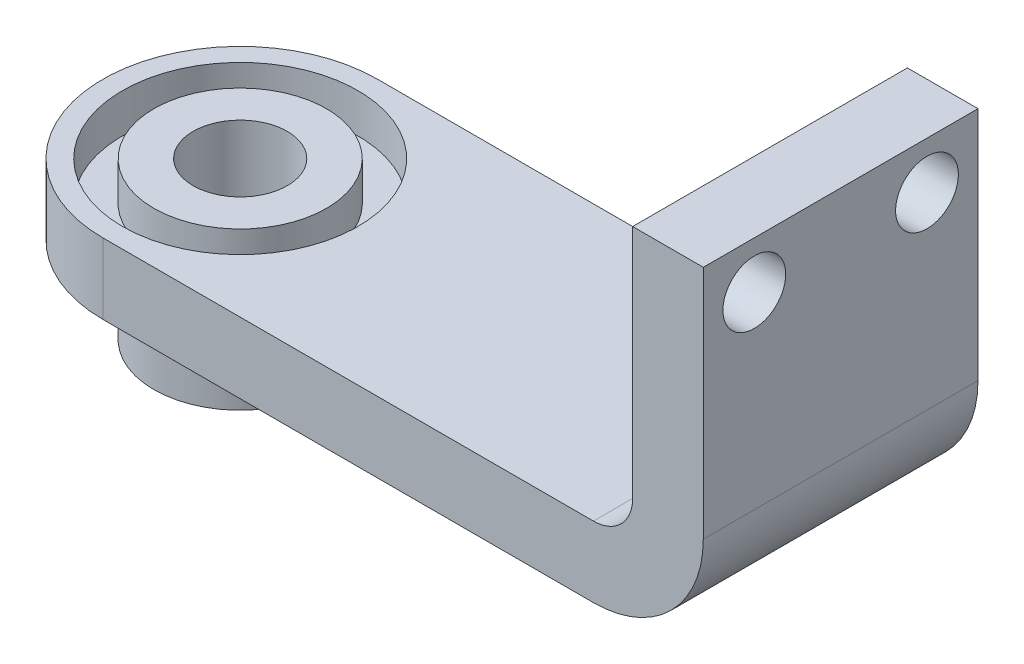
ISO-10303-21;
HEADER;
FILE_DESCRIPTION(('STEP AP214'),'2;1');
FILE_NAME('part.step','',(''),(''),'','','');
FILE_SCHEMA(('AUTOMOTIVE_DESIGN { 1 0 10303 214 1 1 1 1 }'));
ENDSEC;
DATA;
#1=APPLICATION_CONTEXT('core data for automotive mechanical design processes');
#2=APPLICATION_PROTOCOL_DEFINITION('international standard','automotive_design',2000,#1);
#3=PRODUCT_CONTEXT('',#1,'mechanical');
#4=PRODUCT('Part','Part','',(#3));
#5=PRODUCT_RELATED_PRODUCT_CATEGORY('part','',(#4));
#6=PRODUCT_DEFINITION_FORMATION('','',#4);
#7=PRODUCT_DEFINITION_CONTEXT('part definition',#1,'design');
#8=PRODUCT_DEFINITION('design','',#6,#7);
#9=PRODUCT_DEFINITION_SHAPE('','',#8);
#10=(LENGTH_UNIT() NAMED_UNIT(*) SI_UNIT(.MILLI.,.METRE.));
#11=(NAMED_UNIT(*) PLANE_ANGLE_UNIT() SI_UNIT($,.RADIAN.));
#12=(NAMED_UNIT(*) SI_UNIT($,.STERADIAN.) SOLID_ANGLE_UNIT());
#13=UNCERTAINTY_MEASURE_WITH_UNIT(LENGTH_MEASURE(1.E-05),#10,'distance_accuracy_value','');
#14=(GEOMETRIC_REPRESENTATION_CONTEXT(3) GLOBAL_UNCERTAINTY_ASSIGNED_CONTEXT((#13)) GLOBAL_UNIT_ASSIGNED_CONTEXT((#10,
#11,#12)) REPRESENTATION_CONTEXT('',''));
#15=CARTESIAN_POINT('',(0.,0.,0.));
#16=DIRECTION('',(0.,0.,1.));
#17=DIRECTION('',(1.,0.,0.));
#18=AXIS2_PLACEMENT_3D('',#15,#16,#17);
#19=CARTESIAN_POINT('',(-17.5,-20.,-17.5));
#20=DIRECTION('',(0.,1.,0.));
#21=DIRECTION('',(0.,0.,1.));
#22=AXIS2_PLACEMENT_3D('',#19,#20,#21);
#23=CYLINDRICAL_SURFACE('',#22,6.);
#24=CARTESIAN_POINT('',(-17.5,-20.,-17.5));
#25=DIRECTION('',(0.,1.,0.));
#26=DIRECTION('',(0.,0.,1.));
#27=AXIS2_PLACEMENT_3D('',#24,#25,#26);
#28=CIRCLE('',#27,6.);
#29=CARTESIAN_POINT('',(-17.5,-20.,-11.5));
#30=VERTEX_POINT('',#29);
#31=EDGE_CURVE('E50',#30,#30,#28,.T.);
#32=ORIENTED_EDGE('',*,*,#31,.F.);
#33=EDGE_LOOP('',(#32));
#34=FACE_BOUND('',#33,.T.);
#35=CARTESIAN_POINT('',(-17.5,0.,-17.5));
#36=DIRECTION('',(0.,1.,0.));
#37=DIRECTION('',(0.,0.,1.));
#38=AXIS2_PLACEMENT_3D('',#35,#36,#37);
#39=CIRCLE('',#38,6.);
#40=CARTESIAN_POINT('',(-17.5,0.,-11.5));
#41=VERTEX_POINT('',#40);
#42=EDGE_CURVE('E56',#41,#41,#39,.T.);
#43=ORIENTED_EDGE('',*,*,#42,.T.);
#44=EDGE_LOOP('',(#43));
#45=FACE_BOUND('',#44,.T.);
#46=ADVANCED_FACE('F43',(#34,#45),#23,.F.);
#47=CARTESIAN_POINT('',(-17.5,-20.,-17.5));
#48=DIRECTION('',(0.,1.,0.));
#49=DIRECTION('',(0.,0.,1.));
#50=AXIS2_PLACEMENT_3D('',#47,#48,#49);
#51=CYLINDRICAL_SURFACE('',#50,11.);
#52=CARTESIAN_POINT('',(-17.5,-20.,-17.5));
#53=DIRECTION('',(0.,1.,0.));
#54=DIRECTION('',(0.,0.,1.));
#55=AXIS2_PLACEMENT_3D('',#52,#53,#54);
#56=CIRCLE('',#55,11.);
#57=CARTESIAN_POINT('',(-17.5,-20.,-6.5));
#58=VERTEX_POINT('',#57);
#59=EDGE_CURVE('E11',#58,#58,#56,.T.);
#60=ORIENTED_EDGE('',*,*,#59,.T.);
#61=EDGE_LOOP('',(#60));
#62=FACE_BOUND('',#61,.T.);
#63=CARTESIAN_POINT('',(-17.5,0.,-17.5));
#64=DIRECTION('',(0.,1.,0.));
#65=DIRECTION('',(0.,0.,1.));
#66=AXIS2_PLACEMENT_3D('',#63,#64,#65);
#67=CIRCLE('',#66,11.);
#68=CARTESIAN_POINT('',(-17.5,0.,-6.5));
#69=VERTEX_POINT('',#68);
#70=EDGE_CURVE('E46',#69,#69,#67,.T.);
#71=ORIENTED_EDGE('',*,*,#70,.F.);
#72=EDGE_LOOP('',(#71));
#73=FACE_BOUND('',#72,.T.);
#74=ADVANCED_FACE('F65',(#62,#73),#51,.T.);
#75=CARTESIAN_POINT('',(0.,-20.,0.));
#76=DIRECTION('',(0.,1.,0.));
#77=DIRECTION('',(0.,0.,1.));
#78=AXIS2_PLACEMENT_3D('',#75,#76,#77);
#79=PLANE('',#78);
#80=ORIENTED_EDGE('',*,*,#31,.T.);
#81=EDGE_LOOP('',(#80));
#82=FACE_BOUND('',#81,.T.);
#83=ORIENTED_EDGE('',*,*,#59,.F.);
#84=EDGE_LOOP('',(#83));
#85=FACE_BOUND('',#84,.T.);
#86=ADVANCED_FACE('F67',(#82,#85),#79,.F.);
#87=CARTESIAN_POINT('',(0.,0.,0.));
#88=DIRECTION('',(0.,1.,0.));
#89=DIRECTION('',(0.,0.,1.));
#90=AXIS2_PLACEMENT_3D('',#87,#88,#89);
#91=PLANE('',#90);
#92=ORIENTED_EDGE('',*,*,#42,.F.);
#93=EDGE_LOOP('',(#92));
#94=FACE_BOUND('',#93,.T.);
#95=ORIENTED_EDGE('',*,*,#70,.T.);
#96=EDGE_LOOP('',(#95));
#97=FACE_BOUND('',#96,.T.);
#98=ADVANCED_FACE('F63',(#94,#97),#91,.T.);
#99=CLOSED_SHELL('',(#46,#74,#86,#98));
#100=MANIFOLD_SOLID_BREP('B2',#99);
#101=CARTESIAN_POINT('',(-17.5,0.,-35.));
#102=DIRECTION('',(0.,1.,0.));
#103=DIRECTION('',(0.,0.,1.));
#104=AXIS2_PLACEMENT_3D('',#101,#102,#103);
#105=PLANE('',#104);
#106=CARTESIAN_POINT('',(-17.5,0.,-17.5));
#107=DIRECTION('',(0.,1.,0.));
#108=DIRECTION('',(0.,0.,1.));
#109=AXIS2_PLACEMENT_3D('',#106,#107,#108);
#110=CIRCLE('',#109,15.);
#111=CARTESIAN_POINT('',(-17.5,0.,-2.5));
#112=VERTEX_POINT('',#111);
#113=EDGE_CURVE('E276',#112,#112,#110,.T.);
#114=ORIENTED_EDGE('',*,*,#113,.F.);
#115=EDGE_LOOP('',(#114));
#116=FACE_BOUND('',#115,.T.);
#117=DIRECTION('',(-1.,0.,0.));
#118=VECTOR('',#117,1.);
#119=CARTESIAN_POINT('',(-17.5,0.,0.));
#120=LINE('',#119,#118);
#121=CARTESIAN_POINT('',(45.,0.,0.));
#122=VERTEX_POINT('',#121);
#123=CARTESIAN_POINT('',(-17.5,0.,0.));
#124=VERTEX_POINT('',#123);
#125=EDGE_CURVE('E203',#122,#124,#120,.T.);
#126=ORIENTED_EDGE('',*,*,#125,.F.);
#127=DIRECTION('',(0.,0.,1.));
#128=VECTOR('',#127,1.);
#129=CARTESIAN_POINT('',(45.,0.,-35.));
#130=LINE('',#129,#128);
#131=CARTESIAN_POINT('',(45.,0.,-35.));
#132=VERTEX_POINT('',#131);
#133=EDGE_CURVE('E41',#132,#122,#130,.T.);
#134=ORIENTED_EDGE('',*,*,#133,.F.);
#135=DIRECTION('',(-1.,0.,0.));
#136=VECTOR('',#135,1.);
#137=CARTESIAN_POINT('',(-17.5,0.,-35.));
#138=LINE('',#137,#136);
#139=CARTESIAN_POINT('',(-17.5,0.,-35.));
#140=VERTEX_POINT('',#139);
#141=EDGE_CURVE('E224',#132,#140,#138,.T.);
#142=ORIENTED_EDGE('',*,*,#141,.T.);
#143=CARTESIAN_POINT('',(-17.5,0.,-17.5));
#144=DIRECTION('',(0.,1.,0.));
#145=DIRECTION('',(0.,0.,1.));
#146=AXIS2_PLACEMENT_3D('',#143,#144,#145);
#147=CIRCLE('',#146,17.5);
#148=EDGE_CURVE('E236',#140,#124,#147,.T.);
#149=ORIENTED_EDGE('',*,*,#148,.T.);
#150=EDGE_LOOP('',(#126,#134,#142,#149));
#151=FACE_BOUND('',#150,.T.);
#152=ADVANCED_FACE('F111',(#116,#151),#105,.T.);
#153=CARTESIAN_POINT('',(45.,5.,-35.));
#154=DIRECTION('',(0.,0.,1.));
#155=DIRECTION('',(1.,0.,0.));
#156=AXIS2_PLACEMENT_3D('',#153,#154,#155);
#157=CYLINDRICAL_SURFACE('',#156,5.);
#158=CARTESIAN_POINT('',(45.,5.,0.));
#159=DIRECTION('',(0.,0.,-1.));
#160=DIRECTION('',(1.,0.,0.));
#161=AXIS2_PLACEMENT_3D('',#158,#159,#160);
#162=CIRCLE('',#161,5.);
#163=CARTESIAN_POINT('',(50.,5.,0.));
#164=VERTEX_POINT('',#163);
#165=EDGE_CURVE('E222',#164,#122,#162,.T.);
#166=ORIENTED_EDGE('',*,*,#165,.F.);
#167=DIRECTION('',(0.,0.,1.));
#168=VECTOR('',#167,1.);
#169=CARTESIAN_POINT('',(50.,5.,-35.));
#170=LINE('',#169,#168);
#171=CARTESIAN_POINT('',(50.,5.,-35.));
#172=VERTEX_POINT('',#171);
#173=EDGE_CURVE('E120',#172,#164,#170,.T.);
#174=ORIENTED_EDGE('',*,*,#173,.F.);
#175=CARTESIAN_POINT('',(45.,5.,-35.));
#176=DIRECTION('',(0.,0.,-1.));
#177=DIRECTION('',(1.,0.,0.));
#178=AXIS2_PLACEMENT_3D('',#175,#176,#177);
#179=CIRCLE('',#178,5.);
#180=EDGE_CURVE('E193',#172,#132,#179,.T.);
#181=ORIENTED_EDGE('',*,*,#180,.T.);
#182=ORIENTED_EDGE('',*,*,#133,.T.);
#183=EDGE_LOOP('',(#166,#174,#181,#182));
#184=FACE_BOUND('',#183,.T.);
#185=ADVANCED_FACE('F268',(#184),#157,.F.);
#186=CARTESIAN_POINT('',(50.,35.,-35.));
#187=DIRECTION('',(-1.,0.,0.));
#188=DIRECTION('',(0.,-1.,0.));
#189=AXIS2_PLACEMENT_3D('',#186,#187,#188);
#190=PLANE('',#189);
#191=CARTESIAN_POINT('',(50.,29.,-28.5021109871421));
#192=DIRECTION('',(-1.,0.,0.));
#193=DIRECTION('',(0.,-1.,0.));
#194=AXIS2_PLACEMENT_3D('',#191,#192,#193);
#195=CIRCLE('',#194,4.);
#196=CARTESIAN_POINT('',(50.,25.,-28.5021109871421));
#197=VERTEX_POINT('',#196);
#198=EDGE_CURVE('E234',#197,#197,#195,.T.);
#199=ORIENTED_EDGE('',*,*,#198,.F.);
#200=EDGE_LOOP('',(#199));
#201=FACE_BOUND('',#200,.T.);
#202=CARTESIAN_POINT('',(50.,29.,-6.5));
#203=DIRECTION('',(-1.,0.,0.));
#204=DIRECTION('',(0.,-1.,0.));
#205=AXIS2_PLACEMENT_3D('',#202,#203,#204);
#206=CIRCLE('',#205,4.);
#207=CARTESIAN_POINT('',(50.,25.,-6.5));
#208=VERTEX_POINT('',#207);
#209=EDGE_CURVE('E244',#208,#208,#206,.T.);
#210=ORIENTED_EDGE('',*,*,#209,.F.);
#211=EDGE_LOOP('',(#210));
#212=FACE_BOUND('',#211,.T.);
#213=DIRECTION('',(0.,-1.,0.));
#214=VECTOR('',#213,1.);
#215=CARTESIAN_POINT('',(50.,35.,0.));
#216=LINE('',#215,#214);
#217=CARTESIAN_POINT('',(50.,35.,0.));
#218=VERTEX_POINT('',#217);
#219=EDGE_CURVE('E180',#218,#164,#216,.T.);
#220=ORIENTED_EDGE('',*,*,#219,.F.);
#221=DIRECTION('',(0.,0.,1.));
#222=VECTOR('',#221,1.);
#223=CARTESIAN_POINT('',(50.,35.,-35.));
#224=LINE('',#223,#222);
#225=CARTESIAN_POINT('',(50.,35.,-35.));
#226=VERTEX_POINT('',#225);
#227=EDGE_CURVE('E175',#226,#218,#224,.T.);
#228=ORIENTED_EDGE('',*,*,#227,.F.);
#229=DIRECTION('',(0.,-1.,0.));
#230=VECTOR('',#229,1.);
#231=CARTESIAN_POINT('',(50.,35.,-35.));
#232=LINE('',#231,#230);
#233=EDGE_CURVE('E178',#226,#172,#232,.T.);
#234=ORIENTED_EDGE('',*,*,#233,.T.);
#235=ORIENTED_EDGE('',*,*,#173,.T.);
#236=EDGE_LOOP('',(#220,#228,#234,#235));
#237=FACE_BOUND('',#236,.T.);
#238=ADVANCED_FACE('F177',(#201,#212,#237),#190,.T.);
#239=CARTESIAN_POINT('',(59.,35.,-35.));
#240=DIRECTION('',(0.,1.,0.));
#241=DIRECTION('',(-1.,0.,0.));
#242=AXIS2_PLACEMENT_3D('',#239,#240,#241);
#243=PLANE('',#242);
#244=DIRECTION('',(-1.,0.,0.));
#245=VECTOR('',#244,1.);
#246=CARTESIAN_POINT('',(59.,35.,0.));
#247=LINE('',#246,#245);
#248=CARTESIAN_POINT('',(59.,35.,0.));
#249=VERTEX_POINT('',#248);
#250=EDGE_CURVE('E219',#249,#218,#247,.T.);
#251=ORIENTED_EDGE('',*,*,#250,.F.);
#252=DIRECTION('',(0.,0.,1.));
#253=VECTOR('',#252,1.);
#254=CARTESIAN_POINT('',(59.,35.,-35.));
#255=LINE('',#254,#253);
#256=CARTESIAN_POINT('',(59.,35.,-35.));
#257=VERTEX_POINT('',#256);
#258=EDGE_CURVE('E185',#257,#249,#255,.T.);
#259=ORIENTED_EDGE('',*,*,#258,.F.);
#260=DIRECTION('',(-1.,0.,0.));
#261=VECTOR('',#260,1.);
#262=CARTESIAN_POINT('',(59.,35.,-35.));
#263=LINE('',#262,#261);
#264=EDGE_CURVE('E191',#257,#226,#263,.T.);
#265=ORIENTED_EDGE('',*,*,#264,.T.);
#266=ORIENTED_EDGE('',*,*,#227,.T.);
#267=EDGE_LOOP('',(#251,#259,#265,#266));
#268=FACE_BOUND('',#267,.T.);
#269=ADVANCED_FACE('F195',(#268),#243,.T.);
#270=CARTESIAN_POINT('',(59.,5.,-35.));
#271=DIRECTION('',(1.,0.,0.));
#272=DIRECTION('',(0.,0.,-1.));
#273=AXIS2_PLACEMENT_3D('',#270,#271,#272);
#274=PLANE('',#273);
#275=CARTESIAN_POINT('',(59.,29.,-28.5021109871421));
#276=DIRECTION('',(1.,0.,0.));
#277=DIRECTION('',(0.,0.,-1.));
#278=AXIS2_PLACEMENT_3D('',#275,#276,#277);
#279=CIRCLE('',#278,4.);
#280=CARTESIAN_POINT('',(59.,29.,-32.5021109871421));
#281=VERTEX_POINT('',#280);
#282=EDGE_CURVE('E233',#281,#281,#279,.T.);
#283=ORIENTED_EDGE('',*,*,#282,.F.);
#284=EDGE_LOOP('',(#283));
#285=FACE_BOUND('',#284,.T.);
#286=CARTESIAN_POINT('',(59.,29.,-6.5));
#287=DIRECTION('',(1.,0.,0.));
#288=DIRECTION('',(0.,0.,-1.));
#289=AXIS2_PLACEMENT_3D('',#286,#287,#288);
#290=CIRCLE('',#289,4.);
#291=CARTESIAN_POINT('',(59.,29.,-10.5));
#292=VERTEX_POINT('',#291);
#293=EDGE_CURVE('E231',#292,#292,#290,.T.);
#294=ORIENTED_EDGE('',*,*,#293,.F.);
#295=EDGE_LOOP('',(#294));
#296=FACE_BOUND('',#295,.T.);
#297=DIRECTION('',(0.,1.,0.));
#298=VECTOR('',#297,1.);
#299=CARTESIAN_POINT('',(59.,5.,0.));
#300=LINE('',#299,#298);
#301=CARTESIAN_POINT('',(59.,5.,0.));
#302=VERTEX_POINT('',#301);
#303=EDGE_CURVE('E216',#302,#249,#300,.T.);
#304=ORIENTED_EDGE('',*,*,#303,.F.);
#305=DIRECTION('',(0.,0.,1.));
#306=VECTOR('',#305,1.);
#307=CARTESIAN_POINT('',(59.,5.,-35.));
#308=LINE('',#307,#306);
#309=CARTESIAN_POINT('',(59.,5.,-35.));
#310=VERTEX_POINT('',#309);
#311=EDGE_CURVE('E228',#310,#302,#308,.T.);
#312=ORIENTED_EDGE('',*,*,#311,.F.);
#313=DIRECTION('',(0.,1.,0.));
#314=VECTOR('',#313,1.);
#315=CARTESIAN_POINT('',(59.,5.,-35.));
#316=LINE('',#315,#314);
#317=EDGE_CURVE('E196',#310,#257,#316,.T.);
#318=ORIENTED_EDGE('',*,*,#317,.T.);
#319=ORIENTED_EDGE('',*,*,#258,.T.);
#320=EDGE_LOOP('',(#304,#312,#318,#319));
#321=FACE_BOUND('',#320,.T.);
#322=ADVANCED_FACE('F299',(#285,#296,#321),#274,.T.);
#323=CARTESIAN_POINT('',(45.,5.,-35.));
#324=DIRECTION('',(0.,0.,1.));
#325=DIRECTION('',(1.,0.,0.));
#326=AXIS2_PLACEMENT_3D('',#323,#324,#325);
#327=CYLINDRICAL_SURFACE('',#326,14.);
#328=CARTESIAN_POINT('',(45.,5.,0.));
#329=DIRECTION('',(0.,0.,1.));
#330=DIRECTION('',(1.,0.,0.));
#331=AXIS2_PLACEMENT_3D('',#328,#329,#330);
#332=CIRCLE('',#331,14.);
#333=CARTESIAN_POINT('',(45.,-9.,0.));
#334=VERTEX_POINT('',#333);
#335=EDGE_CURVE('E213',#334,#302,#332,.T.);
#336=ORIENTED_EDGE('',*,*,#335,.F.);
#337=DIRECTION('',(0.,0.,1.));
#338=VECTOR('',#337,1.);
#339=CARTESIAN_POINT('',(45.,-9.,-35.));
#340=LINE('',#339,#338);
#341=CARTESIAN_POINT('',(45.,-9.,-35.));
#342=VERTEX_POINT('',#341);
#343=EDGE_CURVE('E165',#342,#334,#340,.T.);
#344=ORIENTED_EDGE('',*,*,#343,.F.);
#345=CARTESIAN_POINT('',(45.,5.,-35.));
#346=DIRECTION('',(0.,0.,1.));
#347=DIRECTION('',(1.,0.,0.));
#348=AXIS2_PLACEMENT_3D('',#345,#346,#347);
#349=CIRCLE('',#348,14.);
#350=EDGE_CURVE('E198',#342,#310,#349,.T.);
#351=ORIENTED_EDGE('',*,*,#350,.T.);
#352=ORIENTED_EDGE('',*,*,#311,.T.);
#353=EDGE_LOOP('',(#336,#344,#351,#352));
#354=FACE_BOUND('',#353,.T.);
#355=ADVANCED_FACE('F253',(#354),#327,.T.);
#356=CARTESIAN_POINT('',(-17.5,-9.,-35.));
#357=DIRECTION('',(0.,-1.,0.));
#358=DIRECTION('',(0.,0.,-1.));
#359=AXIS2_PLACEMENT_3D('',#356,#357,#358);
#360=PLANE('',#359);
#361=CARTESIAN_POINT('',(-17.5,-9.,-17.5));
#362=DIRECTION('',(0.,-1.,0.));
#363=DIRECTION('',(0.,0.,-1.));
#364=AXIS2_PLACEMENT_3D('',#361,#362,#363);
#365=CIRCLE('',#364,11.);
#366=CARTESIAN_POINT('',(-17.5,-9.,-28.5));
#367=VERTEX_POINT('',#366);
#368=EDGE_CURVE('E114',#367,#367,#365,.T.);
#369=ORIENTED_EDGE('',*,*,#368,.F.);
#370=EDGE_LOOP('',(#369));
#371=FACE_BOUND('',#370,.T.);
#372=DIRECTION('',(1.,0.,0.));
#373=VECTOR('',#372,1.);
#374=CARTESIAN_POINT('',(-17.5,-9.,0.));
#375=LINE('',#374,#373);
#376=CARTESIAN_POINT('',(-17.5,-9.,0.));
#377=VERTEX_POINT('',#376);
#378=EDGE_CURVE('E210',#377,#334,#375,.T.);
#379=ORIENTED_EDGE('',*,*,#378,.F.);
#380=CARTESIAN_POINT('',(-17.5,-9.,-17.5));
#381=DIRECTION('',(0.,-1.,0.));
#382=DIRECTION('',(0.,0.,-1.));
#383=AXIS2_PLACEMENT_3D('',#380,#381,#382);
#384=CIRCLE('',#383,17.5);
#385=CARTESIAN_POINT('',(-17.5,-9.00000000000001,-35.));
#386=VERTEX_POINT('',#385);
#387=EDGE_CURVE('E207',#386,#377,#384,.F.);
#388=ORIENTED_EDGE('',*,*,#387,.F.);
#389=DIRECTION('',(1.,0.,0.));
#390=VECTOR('',#389,1.);
#391=CARTESIAN_POINT('',(-17.5,-9.,-35.));
#392=LINE('',#391,#390);
#393=EDGE_CURVE('E251',#386,#342,#392,.T.);
#394=ORIENTED_EDGE('',*,*,#393,.T.);
#395=ORIENTED_EDGE('',*,*,#343,.T.);
#396=EDGE_LOOP('',(#379,#388,#394,#395));
#397=FACE_BOUND('',#396,.T.);
#398=ADVANCED_FACE('F261',(#371,#397),#360,.T.);
#399=CARTESIAN_POINT('',(45.,5.,-35.));
#400=DIRECTION('',(0.,0.,1.));
#401=DIRECTION('',(1.,0.,0.));
#402=AXIS2_PLACEMENT_3D('',#399,#400,#401);
#403=PLANE('',#402);
#404=ORIENTED_EDGE('',*,*,#141,.F.);
#405=ORIENTED_EDGE('',*,*,#180,.F.);
#406=ORIENTED_EDGE('',*,*,#233,.F.);
#407=ORIENTED_EDGE('',*,*,#264,.F.);
#408=ORIENTED_EDGE('',*,*,#317,.F.);
#409=ORIENTED_EDGE('',*,*,#350,.F.);
#410=ORIENTED_EDGE('',*,*,#393,.F.);
#411=DIRECTION('',(0.,-1.,0.));
#412=VECTOR('',#411,1.);
#413=CARTESIAN_POINT('',(-17.5,0.,-35.));
#414=LINE('',#413,#412);
#415=EDGE_CURVE('E248',#140,#386,#414,.T.);
#416=ORIENTED_EDGE('',*,*,#415,.F.);
#417=EDGE_LOOP('',(#404,#405,#406,#407,#408,#409,#410,#416));
#418=FACE_BOUND('',#417,.T.);
#419=ADVANCED_FACE('F189',(#418),#403,.F.);
#420=CARTESIAN_POINT('',(45.,5.,0.));
#421=DIRECTION('',(0.,0.,1.));
#422=DIRECTION('',(1.,0.,0.));
#423=AXIS2_PLACEMENT_3D('',#420,#421,#422);
#424=PLANE('',#423);
#425=ORIENTED_EDGE('',*,*,#125,.T.);
#426=DIRECTION('',(0.,-1.,0.));
#427=VECTOR('',#426,1.);
#428=CARTESIAN_POINT('',(-17.5,0.,0.));
#429=LINE('',#428,#427);
#430=EDGE_CURVE('E206',#124,#377,#429,.T.);
#431=ORIENTED_EDGE('',*,*,#430,.T.);
#432=ORIENTED_EDGE('',*,*,#378,.T.);
#433=ORIENTED_EDGE('',*,*,#335,.T.);
#434=ORIENTED_EDGE('',*,*,#303,.T.);
#435=ORIENTED_EDGE('',*,*,#250,.T.);
#436=ORIENTED_EDGE('',*,*,#219,.T.);
#437=ORIENTED_EDGE('',*,*,#165,.T.);
#438=EDGE_LOOP('',(#425,#431,#432,#433,#434,#435,#436,#437));
#439=FACE_BOUND('',#438,.T.);
#440=ADVANCED_FACE('F312',(#439),#424,.T.);
#441=CARTESIAN_POINT('',(-17.5,-48.1311896062463,-17.5));
#442=DIRECTION('',(0.,1.,0.));
#443=DIRECTION('',(0.,0.,1.));
#444=AXIS2_PLACEMENT_3D('',#441,#442,#443);
#445=CYLINDRICAL_SURFACE('',#444,17.5);
#446=ORIENTED_EDGE('',*,*,#415,.T.);
#447=ORIENTED_EDGE('',*,*,#387,.T.);
#448=ORIENTED_EDGE('',*,*,#430,.F.);
#449=ORIENTED_EDGE('',*,*,#148,.F.);
#450=EDGE_LOOP('',(#446,#447,#448,#449));
#451=FACE_BOUND('',#450,.T.);
#452=ADVANCED_FACE('F266',(#451),#445,.T.);
#453=CARTESIAN_POINT('',(85.,29.,-6.5));
#454=DIRECTION('',(-1.,0.,0.));
#455=DIRECTION('',(0.,-1.,0.));
#456=AXIS2_PLACEMENT_3D('',#453,#454,#455);
#457=CYLINDRICAL_SURFACE('',#456,4.);
#458=ORIENTED_EDGE('',*,*,#293,.T.);
#459=EDGE_LOOP('',(#458));
#460=FACE_BOUND('',#459,.T.);
#461=ORIENTED_EDGE('',*,*,#209,.T.);
#462=EDGE_LOOP('',(#461));
#463=FACE_BOUND('',#462,.T.);
#464=ADVANCED_FACE('F291',(#460,#463),#457,.F.);
#465=CARTESIAN_POINT('',(85.,29.,-28.5021109871421));
#466=DIRECTION('',(-1.,0.,0.));
#467=DIRECTION('',(0.,-1.,0.));
#468=AXIS2_PLACEMENT_3D('',#465,#466,#467);
#469=CYLINDRICAL_SURFACE('',#468,4.);
#470=ORIENTED_EDGE('',*,*,#282,.T.);
#471=EDGE_LOOP('',(#470));
#472=FACE_BOUND('',#471,.T.);
#473=ORIENTED_EDGE('',*,*,#198,.T.);
#474=EDGE_LOOP('',(#473));
#475=FACE_BOUND('',#474,.T.);
#476=ADVANCED_FACE('F331',(#472,#475),#469,.F.);
#477=CARTESIAN_POINT('',(-17.5,-5.,-17.5));
#478=DIRECTION('',(0.,1.,0.));
#479=DIRECTION('',(0.,0.,1.));
#480=AXIS2_PLACEMENT_3D('',#477,#478,#479);
#481=CYLINDRICAL_SURFACE('',#480,15.);
#482=CARTESIAN_POINT('',(-17.5,-5.,-17.5));
#483=DIRECTION('',(0.,1.,0.));
#484=DIRECTION('',(0.,0.,1.));
#485=AXIS2_PLACEMENT_3D('',#482,#483,#484);
#486=CIRCLE('',#485,15.);
#487=CARTESIAN_POINT('',(-17.5,-5.,-2.5));
#488=VERTEX_POINT('',#487);
#489=EDGE_CURVE('E278',#488,#488,#486,.T.);
#490=ORIENTED_EDGE('',*,*,#489,.F.);
#491=EDGE_LOOP('',(#490));
#492=FACE_BOUND('',#491,.T.);
#493=ORIENTED_EDGE('',*,*,#113,.T.);
#494=EDGE_LOOP('',(#493));
#495=FACE_BOUND('',#494,.T.);
#496=ADVANCED_FACE('F326',(#492,#495),#481,.F.);
#497=CARTESIAN_POINT('',(-17.5,-5.,-17.5));
#498=DIRECTION('',(0.,1.,0.));
#499=DIRECTION('',(0.,0.,1.));
#500=AXIS2_PLACEMENT_3D('',#497,#498,#499);
#501=PLANE('',#500);
#502=CARTESIAN_POINT('',(-17.5,-5.,-17.5));
#503=DIRECTION('',(0.,1.,0.));
#504=DIRECTION('',(0.,0.,1.));
#505=AXIS2_PLACEMENT_3D('',#502,#503,#504);
#506=CIRCLE('',#505,11.);
#507=CARTESIAN_POINT('',(-17.5,-5.,-6.5));
#508=VERTEX_POINT('',#507);
#509=EDGE_CURVE('E283',#508,#508,#506,.T.);
#510=ORIENTED_EDGE('',*,*,#509,.F.);
#511=EDGE_LOOP('',(#510));
#512=FACE_BOUND('',#511,.T.);
#513=ORIENTED_EDGE('',*,*,#489,.T.);
#514=EDGE_LOOP('',(#513));
#515=FACE_BOUND('',#514,.T.);
#516=ADVANCED_FACE('F319',(#512,#515),#501,.T.);
#517=CARTESIAN_POINT('',(-17.5,-30.,-17.5));
#518=DIRECTION('',(0.,1.,0.));
#519=DIRECTION('',(0.,0.,1.));
#520=AXIS2_PLACEMENT_3D('',#517,#518,#519);
#521=CYLINDRICAL_SURFACE('',#520,11.);
#522=ORIENTED_EDGE('',*,*,#368,.T.);
#523=EDGE_LOOP('',(#522));
#524=FACE_BOUND('',#523,.T.);
#525=ORIENTED_EDGE('',*,*,#509,.T.);
#526=EDGE_LOOP('',(#525));
#527=FACE_BOUND('',#526,.T.);
#528=ADVANCED_FACE('F316',(#524,#527),#521,.F.);
#529=CLOSED_SHELL('',(#152,#185,#238,#269,#322,#355,#398,#419,#440,#452,#464,#476,#496,#516,#528));
#530=MANIFOLD_SOLID_BREP('B6',#529);
#531=ADVANCED_BREP_SHAPE_REPRESENTATION('',(#18,#100,#530),#14);
#532=SHAPE_DEFINITION_REPRESENTATION(#9,#531);
ENDSEC;
END-ISO-10303-21;
